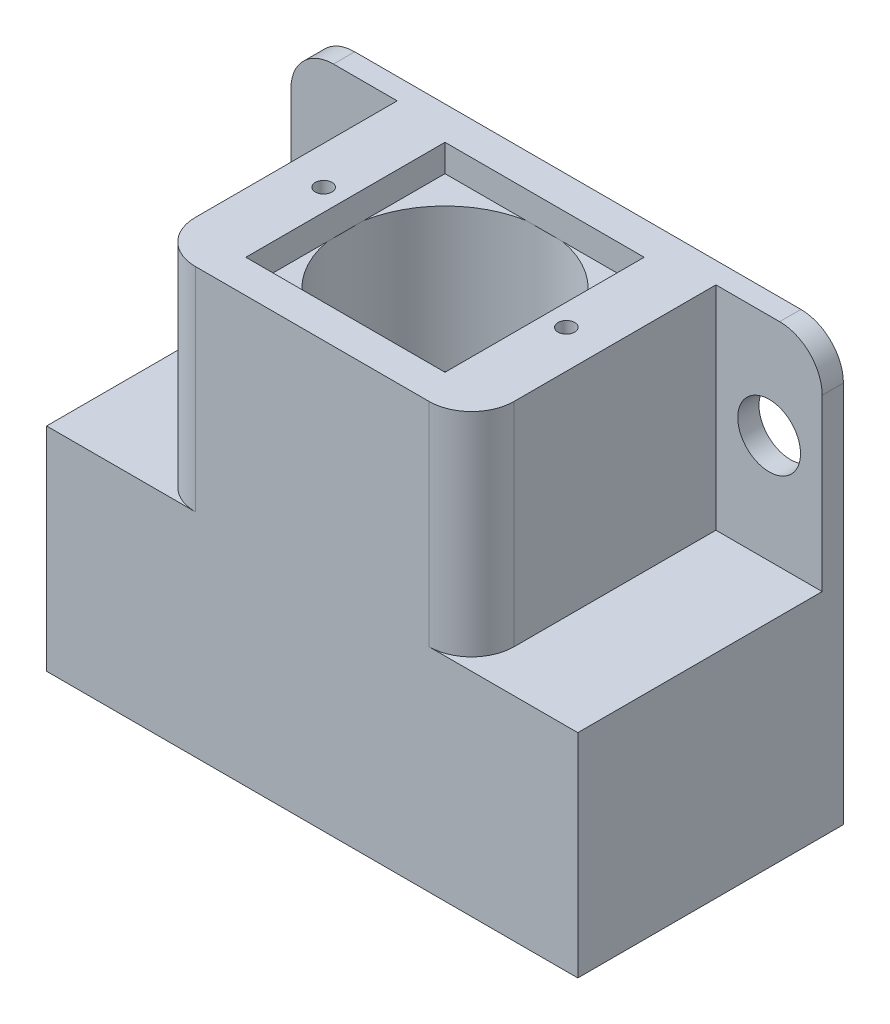
ISO-10303-21;
HEADER;
FILE_DESCRIPTION(('STEP AP214'),'2;1');
FILE_NAME('part.step','',(''),(''),'','','');
FILE_SCHEMA(('AUTOMOTIVE_DESIGN { 1 0 10303 214 1 1 1 1 }'));
ENDSEC;
DATA;
#1=APPLICATION_CONTEXT('core data for automotive mechanical design processes');
#2=APPLICATION_PROTOCOL_DEFINITION('international standard','automotive_design',2000,#1);
#3=PRODUCT_CONTEXT('',#1,'mechanical');
#4=PRODUCT('Part','Part','',(#3));
#5=PRODUCT_RELATED_PRODUCT_CATEGORY('part','',(#4));
#6=PRODUCT_DEFINITION_FORMATION('','',#4);
#7=PRODUCT_DEFINITION_CONTEXT('part definition',#1,'design');
#8=PRODUCT_DEFINITION('design','',#6,#7);
#9=PRODUCT_DEFINITION_SHAPE('','',#8);
#10=(LENGTH_UNIT() NAMED_UNIT(*) SI_UNIT(.MILLI.,.METRE.));
#11=(NAMED_UNIT(*) PLANE_ANGLE_UNIT() SI_UNIT($,.RADIAN.));
#12=(NAMED_UNIT(*) SI_UNIT($,.STERADIAN.) SOLID_ANGLE_UNIT());
#13=UNCERTAINTY_MEASURE_WITH_UNIT(LENGTH_MEASURE(1.E-05),#10,'distance_accuracy_value','');
#14=(GEOMETRIC_REPRESENTATION_CONTEXT(3) GLOBAL_UNCERTAINTY_ASSIGNED_CONTEXT((#13)) GLOBAL_UNIT_ASSIGNED_CONTEXT((#10,
#11,#12)) REPRESENTATION_CONTEXT('',''));
#15=CARTESIAN_POINT('',(0.,0.,0.));
#16=DIRECTION('',(0.,0.,1.));
#17=DIRECTION('',(1.,0.,0.));
#18=AXIS2_PLACEMENT_3D('',#15,#16,#17);
#19=CARTESIAN_POINT('',(0.,-3.25,0.));
#20=DIRECTION('',(0.,1.,0.));
#21=DIRECTION('',(0.,0.,1.));
#22=AXIS2_PLACEMENT_3D('',#19,#20,#21);
#23=PLANE('',#22);
#24=CARTESIAN_POINT('',(0.,-3.25,0.));
#25=DIRECTION('',(0.,1.,0.));
#26=DIRECTION('',(0.,0.,1.));
#27=AXIS2_PLACEMENT_3D('',#24,#25,#26);
#28=CIRCLE('',#27,12.108);
#29=CARTESIAN_POINT('',(2.20893493829518,-3.25,11.9048003107309));
#30=VERTEX_POINT('',#29);
#31=CARTESIAN_POINT('',(11.9048003107309,-3.25,2.20893493829519));
#32=VERTEX_POINT('',#31);
#33=EDGE_CURVE('E204',#30,#32,#28,.T.);
#34=ORIENTED_EDGE('',*,*,#33,.F.);
#35=DIRECTION('',(1.,0.,0.));
#36=VECTOR('',#35,1.);
#37=CARTESIAN_POINT('',(-11.9048003107309,-3.25,11.9048003107309));
#38=LINE('',#37,#36);
#39=CARTESIAN_POINT('',(11.9048003107309,-3.25,11.9048003107309));
#40=VERTEX_POINT('',#39);
#41=EDGE_CURVE('E197',#30,#40,#38,.T.);
#42=ORIENTED_EDGE('',*,*,#41,.T.);
#43=DIRECTION('',(0.,0.,-1.));
#44=VECTOR('',#43,1.);
#45=CARTESIAN_POINT('',(11.9048003107309,-3.25,11.9048003107309));
#46=LINE('',#45,#44);
#47=EDGE_CURVE('E215',#40,#32,#46,.T.);
#48=ORIENTED_EDGE('',*,*,#47,.T.);
#49=EDGE_LOOP('',(#34,#42,#48));
#50=FACE_BOUND('',#49,.T.);
#51=ADVANCED_FACE('F40',(#50),#23,.T.);
#52=CARTESIAN_POINT('',(11.9048003107309,-3.25,-2.20893493829518));
#53=VERTEX_POINT('',#52);
#54=CARTESIAN_POINT('',(2.20893493829518,-3.25,-11.9048003107309));
#55=VERTEX_POINT('',#54);
#56=EDGE_CURVE('E466',#53,#55,#28,.T.);
#57=ORIENTED_EDGE('',*,*,#56,.F.);
#58=CARTESIAN_POINT('',(11.9048003107309,-3.25,-11.9048003107309));
#59=VERTEX_POINT('',#58);
#60=EDGE_CURVE('E227',#53,#59,#46,.T.);
#61=ORIENTED_EDGE('',*,*,#60,.T.);
#62=DIRECTION('',(-1.,0.,0.));
#63=VECTOR('',#62,1.);
#64=CARTESIAN_POINT('',(11.9048003107309,-3.25,-11.9048003107309));
#65=LINE('',#64,#63);
#66=EDGE_CURVE('E238',#59,#55,#65,.T.);
#67=ORIENTED_EDGE('',*,*,#66,.T.);
#68=EDGE_LOOP('',(#57,#61,#67));
#69=FACE_BOUND('',#68,.T.);
#70=ADVANCED_FACE('F563',(#69),#23,.T.);
#71=CARTESIAN_POINT('',(-2.20893493829518,-3.25,-11.9048003107309));
#72=VERTEX_POINT('',#71);
#73=CARTESIAN_POINT('',(-11.9048003107309,-3.25,-2.20893493829518));
#74=VERTEX_POINT('',#73);
#75=EDGE_CURVE('E878',#72,#74,#28,.T.);
#76=ORIENTED_EDGE('',*,*,#75,.F.);
#77=CARTESIAN_POINT('',(-11.9048003107309,-3.25,-11.9048003107309));
#78=VERTEX_POINT('',#77);
#79=EDGE_CURVE('E236',#72,#78,#65,.T.);
#80=ORIENTED_EDGE('',*,*,#79,.T.);
#81=DIRECTION('',(0.,0.,1.));
#82=VECTOR('',#81,1.);
#83=CARTESIAN_POINT('',(-11.9048003107309,-3.25,-11.9048003107309));
#84=LINE('',#83,#82);
#85=EDGE_CURVE('E248',#78,#74,#84,.T.);
#86=ORIENTED_EDGE('',*,*,#85,.T.);
#87=EDGE_LOOP('',(#76,#80,#86));
#88=FACE_BOUND('',#87,.T.);
#89=ADVANCED_FACE('F569',(#88),#23,.T.);
#90=CARTESIAN_POINT('',(-31.75,-12.7,0.));
#91=DIRECTION('',(-1.,0.,0.));
#92=DIRECTION('',(0.,0.,1.));
#93=AXIS2_PLACEMENT_3D('',#90,#91,#92);
#94=PLANE('',#93);
#95=DIRECTION('',(0.,1.,0.));
#96=VECTOR('',#95,1.);
#97=CARTESIAN_POINT('',(-31.75,-25.4,-13.335));
#98=LINE('',#97,#96);
#99=CARTESIAN_POINT('',(-31.75,-25.4,-13.335));
#100=VERTEX_POINT('',#99);
#101=CARTESIAN_POINT('',(-31.75,-5.08,-13.335));
#102=VERTEX_POINT('',#101);
#103=EDGE_CURVE('E279',#100,#102,#98,.T.);
#104=ORIENTED_EDGE('',*,*,#103,.T.);
#105=DIRECTION('',(0.,0.,1.));
#106=VECTOR('',#105,1.);
#107=CARTESIAN_POINT('',(-31.75,-5.08,-15.875));
#108=LINE('',#107,#106);
#109=CARTESIAN_POINT('',(-31.75,-5.08,-15.875));
#110=VERTEX_POINT('',#109);
#111=EDGE_CURVE('E482',#102,#110,#108,.F.);
#112=ORIENTED_EDGE('',*,*,#111,.T.);
#113=DIRECTION('',(0.,1.,0.));
#114=VECTOR('',#113,1.);
#115=CARTESIAN_POINT('',(-31.75,-25.4,-15.875));
#116=LINE('',#115,#114);
#117=CARTESIAN_POINT('',(-31.75,-50.8,-15.875));
#118=VERTEX_POINT('',#117);
#119=EDGE_CURVE('E323',#118,#110,#116,.T.);
#120=ORIENTED_EDGE('',*,*,#119,.F.);
#121=DIRECTION('',(0.,0.,-1.));
#122=VECTOR('',#121,1.);
#123=CARTESIAN_POINT('',(-31.75,-50.8,15.875));
#124=LINE('',#123,#122);
#125=CARTESIAN_POINT('',(-31.75,-50.8,15.875));
#126=VERTEX_POINT('',#125);
#127=EDGE_CURVE('E312',#126,#118,#124,.T.);
#128=ORIENTED_EDGE('',*,*,#127,.F.);
#129=DIRECTION('',(0.,-1.,0.));
#130=VECTOR('',#129,1.);
#131=CARTESIAN_POINT('',(-31.75,-12.7,15.875));
#132=LINE('',#131,#130);
#133=CARTESIAN_POINT('',(-31.75,-25.4,15.875));
#134=VERTEX_POINT('',#133);
#135=EDGE_CURVE('E321',#134,#126,#132,.T.);
#136=ORIENTED_EDGE('',*,*,#135,.F.);
#137=DIRECTION('',(0.,0.,1.));
#138=VECTOR('',#137,1.);
#139=CARTESIAN_POINT('',(-31.75,-25.4,-13.335));
#140=LINE('',#139,#138);
#141=EDGE_CURVE('E263',#100,#134,#140,.T.);
#142=ORIENTED_EDGE('',*,*,#141,.F.);
#143=EDGE_LOOP('',(#104,#112,#120,#128,#136,#142));
#144=FACE_BOUND('',#143,.T.);
#145=ADVANCED_FACE('F525',(#144),#94,.T.);
#146=CARTESIAN_POINT('',(31.75,-12.7,0.));
#147=DIRECTION('',(1.,0.,0.));
#148=DIRECTION('',(0.,0.,-1.));
#149=AXIS2_PLACEMENT_3D('',#146,#147,#148);
#150=PLANE('',#149);
#151=DIRECTION('',(0.,1.,0.));
#152=VECTOR('',#151,1.);
#153=CARTESIAN_POINT('',(31.75,-25.4,-15.875));
#154=LINE('',#153,#152);
#155=CARTESIAN_POINT('',(31.75,-5.08,-15.875));
#156=VERTEX_POINT('',#155);
#157=CARTESIAN_POINT('',(31.75,-50.8,-15.875));
#158=VERTEX_POINT('',#157);
#159=EDGE_CURVE('E329',#156,#158,#154,.F.);
#160=ORIENTED_EDGE('',*,*,#159,.F.);
#161=DIRECTION('',(0.,0.,1.));
#162=VECTOR('',#161,1.);
#163=CARTESIAN_POINT('',(31.75,-5.08,-13.335));
#164=LINE('',#163,#162);
#165=CARTESIAN_POINT('',(31.75,-5.08,-13.335));
#166=VERTEX_POINT('',#165);
#167=EDGE_CURVE('E491',#156,#166,#164,.T.);
#168=ORIENTED_EDGE('',*,*,#167,.T.);
#169=DIRECTION('',(0.,1.,0.));
#170=VECTOR('',#169,1.);
#171=CARTESIAN_POINT('',(31.75,-25.4,-13.335));
#172=LINE('',#171,#170);
#173=CARTESIAN_POINT('',(31.75,-25.4,-13.335));
#174=VERTEX_POINT('',#173);
#175=EDGE_CURVE('E297',#174,#166,#172,.T.);
#176=ORIENTED_EDGE('',*,*,#175,.F.);
#177=DIRECTION('',(0.,0.,-1.));
#178=VECTOR('',#177,1.);
#179=CARTESIAN_POINT('',(31.75,-25.4,15.875));
#180=LINE('',#179,#178);
#181=CARTESIAN_POINT('',(31.75,-25.4,15.875));
#182=VERTEX_POINT('',#181);
#183=EDGE_CURVE('E287',#182,#174,#180,.T.);
#184=ORIENTED_EDGE('',*,*,#183,.F.);
#185=DIRECTION('',(0.,1.,0.));
#186=VECTOR('',#185,1.);
#187=CARTESIAN_POINT('',(31.75,-12.7,15.875));
#188=LINE('',#187,#186);
#189=CARTESIAN_POINT('',(31.75,-50.8,15.875));
#190=VERTEX_POINT('',#189);
#191=EDGE_CURVE('E318',#190,#182,#188,.T.);
#192=ORIENTED_EDGE('',*,*,#191,.F.);
#193=DIRECTION('',(0.,0.,1.));
#194=VECTOR('',#193,1.);
#195=CARTESIAN_POINT('',(31.75,-50.8,-15.875));
#196=LINE('',#195,#194);
#197=EDGE_CURVE('E304',#158,#190,#196,.T.);
#198=ORIENTED_EDGE('',*,*,#197,.F.);
#199=EDGE_LOOP('',(#160,#168,#176,#184,#192,#198));
#200=FACE_BOUND('',#199,.T.);
#201=ADVANCED_FACE('F535',(#200),#150,.T.);
#202=CARTESIAN_POINT('',(0.,-25.4,15.875));
#203=DIRECTION('',(0.,0.,-1.));
#204=DIRECTION('',(-1.,0.,0.));
#205=AXIS2_PLACEMENT_3D('',#202,#203,#204);
#206=PLANE('',#205);
#207=DIRECTION('',(1.,0.,0.));
#208=VECTOR('',#207,1.);
#209=CARTESIAN_POINT('',(19.05,-25.4,15.875));
#210=LINE('',#209,#208);
#211=CARTESIAN_POINT('',(13.97,-25.4,15.875));
#212=VERTEX_POINT('',#211);
#213=EDGE_CURVE('E285',#212,#182,#210,.T.);
#214=ORIENTED_EDGE('',*,*,#213,.F.);
#215=DIRECTION('',(0.,1.,0.));
#216=VECTOR('',#215,1.);
#217=CARTESIAN_POINT('',(13.97,-25.4,15.875));
#218=LINE('',#217,#216);
#219=CARTESIAN_POINT('',(13.97,0.,15.875));
#220=VERTEX_POINT('',#219);
#221=EDGE_CURVE('E465',#212,#220,#218,.T.);
#222=ORIENTED_EDGE('',*,*,#221,.T.);
#223=DIRECTION('',(1.,0.,0.));
#224=VECTOR('',#223,1.);
#225=CARTESIAN_POINT('',(0.,0.,15.875));
#226=LINE('',#225,#224);
#227=CARTESIAN_POINT('',(-13.97,0.,15.875));
#228=VERTEX_POINT('',#227);
#229=EDGE_CURVE('E324',#220,#228,#226,.F.);
#230=ORIENTED_EDGE('',*,*,#229,.T.);
#231=DIRECTION('',(0.,1.,0.));
#232=VECTOR('',#231,1.);
#233=CARTESIAN_POINT('',(-13.97,-25.4,15.875));
#234=LINE('',#233,#232);
#235=CARTESIAN_POINT('',(-13.97,-25.4,15.875));
#236=VERTEX_POINT('',#235);
#237=EDGE_CURVE('E461',#228,#236,#234,.F.);
#238=ORIENTED_EDGE('',*,*,#237,.T.);
#239=DIRECTION('',(1.,0.,0.));
#240=VECTOR('',#239,1.);
#241=CARTESIAN_POINT('',(-31.75,-25.4,15.875));
#242=LINE('',#241,#240);
#243=EDGE_CURVE('E265',#134,#236,#242,.T.);
#244=ORIENTED_EDGE('',*,*,#243,.F.);
#245=ORIENTED_EDGE('',*,*,#135,.T.);
#246=DIRECTION('',(-1.,0.,0.));
#247=VECTOR('',#246,1.);
#248=CARTESIAN_POINT('',(31.75,-50.8,15.875));
#249=LINE('',#248,#247);
#250=EDGE_CURVE('E309',#190,#126,#249,.T.);
#251=ORIENTED_EDGE('',*,*,#250,.F.);
#252=ORIENTED_EDGE('',*,*,#191,.T.);
#253=EDGE_LOOP('',(#214,#222,#230,#238,#244,#245,#251,#252));
#254=FACE_BOUND('',#253,.T.);
#255=ADVANCED_FACE('F505',(#254),#206,.F.);
#256=CARTESIAN_POINT('',(0.,-25.4,-15.875));
#257=DIRECTION('',(0.,0.,-1.));
#258=DIRECTION('',(-1.,0.,0.));
#259=AXIS2_PLACEMENT_3D('',#256,#257,#258);
#260=PLANE('',#259);
#261=CARTESIAN_POINT('',(-25.4129609454085,-12.4235546093226,-15.875));
#262=DIRECTION('',(0.,0.,-1.));
#263=DIRECTION('',(-1.,0.,0.));
#264=AXIS2_PLACEMENT_3D('',#261,#262,#263);
#265=CIRCLE('',#264,3.75399999999999);
#266=CARTESIAN_POINT('',(-29.1669609454085,-12.4235546093226,-15.875));
#267=VERTEX_POINT('',#266);
#268=EDGE_CURVE('E900',#267,#267,#265,.T.);
#269=ORIENTED_EDGE('',*,*,#268,.F.);
#270=EDGE_LOOP('',(#269));
#271=FACE_BOUND('',#270,.T.);
#272=CARTESIAN_POINT('',(25.4129609454085,-12.4235546093226,-15.875));
#273=DIRECTION('',(0.,0.,-1.));
#274=DIRECTION('',(-1.,0.,0.));
#275=AXIS2_PLACEMENT_3D('',#272,#273,#274);
#276=CIRCLE('',#275,3.75399999999999);
#277=CARTESIAN_POINT('',(21.6589609454085,-12.4235546093226,-15.875));
#278=VERTEX_POINT('',#277);
#279=EDGE_CURVE('E895',#278,#278,#276,.T.);
#280=ORIENTED_EDGE('',*,*,#279,.F.);
#281=EDGE_LOOP('',(#280));
#282=FACE_BOUND('',#281,.T.);
#283=ORIENTED_EDGE('',*,*,#119,.T.);
#284=CARTESIAN_POINT('',(-26.67,-5.08,-15.875));
#285=DIRECTION('',(0.,0.,-1.));
#286=DIRECTION('',(-1.,0.,0.));
#287=AXIS2_PLACEMENT_3D('',#284,#285,#286);
#288=CIRCLE('',#287,5.08);
#289=CARTESIAN_POINT('',(-26.67,0.,-15.875));
#290=VERTEX_POINT('',#289);
#291=EDGE_CURVE('E486',#110,#290,#288,.T.);
#292=ORIENTED_EDGE('',*,*,#291,.T.);
#293=DIRECTION('',(1.,0.,0.));
#294=VECTOR('',#293,1.);
#295=CARTESIAN_POINT('',(0.,0.,-15.875));
#296=LINE('',#295,#294);
#297=CARTESIAN_POINT('',(26.67,0.,-15.875));
#298=VERTEX_POINT('',#297);
#299=EDGE_CURVE('E328',#290,#298,#296,.T.);
#300=ORIENTED_EDGE('',*,*,#299,.T.);
#301=CARTESIAN_POINT('',(26.67,-5.08,-15.875));
#302=DIRECTION('',(0.,0.,-1.));
#303=DIRECTION('',(-1.,0.,0.));
#304=AXIS2_PLACEMENT_3D('',#301,#302,#303);
#305=CIRCLE('',#304,5.08);
#306=EDGE_CURVE('E484',#298,#156,#305,.T.);
#307=ORIENTED_EDGE('',*,*,#306,.T.);
#308=ORIENTED_EDGE('',*,*,#159,.T.);
#309=DIRECTION('',(1.,0.,0.));
#310=VECTOR('',#309,1.);
#311=CARTESIAN_POINT('',(-31.75,-50.8,-15.875));
#312=LINE('',#311,#310);
#313=EDGE_CURVE('E315',#118,#158,#312,.T.);
#314=ORIENTED_EDGE('',*,*,#313,.F.);
#315=EDGE_LOOP('',(#283,#292,#300,#307,#308,#314));
#316=FACE_BOUND('',#315,.T.);
#317=ADVANCED_FACE('F544',(#271,#282,#316),#260,.T.);
#318=CARTESIAN_POINT('',(0.,0.,0.));
#319=DIRECTION('',(0.,-1.,0.));
#320=DIRECTION('',(0.,0.,-1.));
#321=AXIS2_PLACEMENT_3D('',#318,#319,#320);
#322=PLANE('',#321);
#323=CARTESIAN_POINT('',(14.5034,0.,0.));
#324=DIRECTION('',(0.,1.,0.));
#325=DIRECTION('',(0.,0.,1.));
#326=AXIS2_PLACEMENT_3D('',#323,#324,#325);
#327=CIRCLE('',#326,0.999999999999989);
#328=CARTESIAN_POINT('',(14.5034,0.,0.999999999999989));
#329=VERTEX_POINT('',#328);
#330=EDGE_CURVE('E889',#329,#329,#327,.T.);
#331=ORIENTED_EDGE('',*,*,#330,.F.);
#332=EDGE_LOOP('',(#331));
#333=FACE_BOUND('',#332,.T.);
#334=CARTESIAN_POINT('',(-14.5034,0.,0.));
#335=DIRECTION('',(0.,1.,0.));
#336=DIRECTION('',(0.,0.,1.));
#337=AXIS2_PLACEMENT_3D('',#334,#335,#336);
#338=CIRCLE('',#337,0.999999999999989);
#339=CARTESIAN_POINT('',(-14.5034,0.,0.999999999999989));
#340=VERTEX_POINT('',#339);
#341=EDGE_CURVE('E883',#340,#340,#338,.T.);
#342=ORIENTED_EDGE('',*,*,#341,.F.);
#343=EDGE_LOOP('',(#342));
#344=FACE_BOUND('',#343,.T.);
#345=DIRECTION('',(0.,0.,-1.));
#346=VECTOR('',#345,1.);
#347=CARTESIAN_POINT('',(11.9048003107309,0.,11.9048003107309));
#348=LINE('',#347,#346);
#349=CARTESIAN_POINT('',(11.9048003107309,0.,11.9048003107309));
#350=VERTEX_POINT('',#349);
#351=CARTESIAN_POINT('',(11.9048003107309,0.,-11.9048003107309));
#352=VERTEX_POINT('',#351);
#353=EDGE_CURVE('E869',#350,#352,#348,.T.);
#354=ORIENTED_EDGE('',*,*,#353,.F.);
#355=DIRECTION('',(1.,0.,0.));
#356=VECTOR('',#355,1.);
#357=CARTESIAN_POINT('',(-11.9048003107309,0.,11.9048003107309));
#358=LINE('',#357,#356);
#359=CARTESIAN_POINT('',(-11.9048003107309,0.,11.9048003107309));
#360=VERTEX_POINT('',#359);
#361=EDGE_CURVE('E868',#360,#350,#358,.T.);
#362=ORIENTED_EDGE('',*,*,#361,.F.);
#363=DIRECTION('',(0.,0.,1.));
#364=VECTOR('',#363,1.);
#365=CARTESIAN_POINT('',(-11.9048003107309,0.,-11.9048003107309));
#366=LINE('',#365,#364);
#367=CARTESIAN_POINT('',(-11.9048003107309,0.,-11.9048003107309));
#368=VERTEX_POINT('',#367);
#369=EDGE_CURVE('E221',#368,#360,#366,.T.);
#370=ORIENTED_EDGE('',*,*,#369,.F.);
#371=DIRECTION('',(-1.,0.,0.));
#372=VECTOR('',#371,1.);
#373=CARTESIAN_POINT('',(11.9048003107309,0.,-11.9048003107309));
#374=LINE('',#373,#372);
#375=EDGE_CURVE('E223',#352,#368,#374,.T.);
#376=ORIENTED_EDGE('',*,*,#375,.F.);
#377=EDGE_LOOP('',(#354,#362,#370,#376));
#378=FACE_BOUND('',#377,.T.);
#379=ORIENTED_EDGE('',*,*,#229,.F.);
#380=CARTESIAN_POINT('',(13.97,0.,10.795));
#381=DIRECTION('',(0.,-1.,0.));
#382=DIRECTION('',(0.,0.,-1.));
#383=AXIS2_PLACEMENT_3D('',#380,#381,#382);
#384=CIRCLE('',#383,5.08);
#385=CARTESIAN_POINT('',(19.05,0.,10.795));
#386=VERTEX_POINT('',#385);
#387=EDGE_CURVE('E476',#220,#386,#384,.F.);
#388=ORIENTED_EDGE('',*,*,#387,.T.);
#389=DIRECTION('',(0.,0.,1.));
#390=VECTOR('',#389,1.);
#391=CARTESIAN_POINT('',(19.05,0.,-13.335));
#392=LINE('',#391,#390);
#393=CARTESIAN_POINT('',(19.05,0.,-13.335));
#394=VERTEX_POINT('',#393);
#395=EDGE_CURVE('E288',#394,#386,#392,.T.);
#396=ORIENTED_EDGE('',*,*,#395,.F.);
#397=DIRECTION('',(-1.,0.,0.));
#398=VECTOR('',#397,1.);
#399=CARTESIAN_POINT('',(31.75,0.,-13.335));
#400=LINE('',#399,#398);
#401=CARTESIAN_POINT('',(26.67,0.,-13.335));
#402=VERTEX_POINT('',#401);
#403=EDGE_CURVE('E282',#402,#394,#400,.T.);
#404=ORIENTED_EDGE('',*,*,#403,.F.);
#405=DIRECTION('',(0.,0.,1.));
#406=VECTOR('',#405,1.);
#407=CARTESIAN_POINT('',(26.67,0.,-15.875));
#408=LINE('',#407,#406);
#409=EDGE_CURVE('E469',#402,#298,#408,.F.);
#410=ORIENTED_EDGE('',*,*,#409,.T.);
#411=ORIENTED_EDGE('',*,*,#299,.F.);
#412=DIRECTION('',(0.,0.,1.));
#413=VECTOR('',#412,1.);
#414=CARTESIAN_POINT('',(-26.67,0.,-13.335));
#415=LINE('',#414,#413);
#416=CARTESIAN_POINT('',(-26.67,0.,-13.335));
#417=VERTEX_POINT('',#416);
#418=EDGE_CURVE('E473',#290,#417,#415,.T.);
#419=ORIENTED_EDGE('',*,*,#418,.T.);
#420=DIRECTION('',(-1.,0.,0.));
#421=VECTOR('',#420,1.);
#422=CARTESIAN_POINT('',(-19.05,0.,-13.335));
#423=LINE('',#422,#421);
#424=CARTESIAN_POINT('',(-19.05,0.,-13.335));
#425=VERTEX_POINT('',#424);
#426=EDGE_CURVE('E266',#425,#417,#423,.T.);
#427=ORIENTED_EDGE('',*,*,#426,.F.);
#428=DIRECTION('',(0.,0.,-1.));
#429=VECTOR('',#428,1.);
#430=CARTESIAN_POINT('',(-19.05,0.,15.875));
#431=LINE('',#430,#429);
#432=CARTESIAN_POINT('',(-19.05,0.,10.795));
#433=VERTEX_POINT('',#432);
#434=EDGE_CURVE('E274',#433,#425,#431,.T.);
#435=ORIENTED_EDGE('',*,*,#434,.F.);
#436=CARTESIAN_POINT('',(-13.97,0.,10.795));
#437=DIRECTION('',(0.,-1.,0.));
#438=DIRECTION('',(0.,0.,-1.));
#439=AXIS2_PLACEMENT_3D('',#436,#437,#438);
#440=CIRCLE('',#439,5.08);
#441=EDGE_CURVE('E471',#433,#228,#440,.F.);
#442=ORIENTED_EDGE('',*,*,#441,.T.);
#443=EDGE_LOOP('',(#379,#388,#396,#404,#410,#411,#419,#427,#435,#442));
#444=FACE_BOUND('',#443,.T.);
#445=ADVANCED_FACE('F508',(#333,#344,#378,#444),#322,.F.);
#446=CARTESIAN_POINT('',(0.,-50.8,0.));
#447=DIRECTION('',(0.,-1.,0.));
#448=DIRECTION('',(0.,0.,-1.));
#449=AXIS2_PLACEMENT_3D('',#446,#447,#448);
#450=PLANE('',#449);
#451=CARTESIAN_POINT('',(0.,-50.8,0.));
#452=DIRECTION('',(0.,1.,0.));
#453=DIRECTION('',(0.,0.,1.));
#454=AXIS2_PLACEMENT_3D('',#451,#452,#453);
#455=CIRCLE('',#454,12.108);
#456=CARTESIAN_POINT('',(0.,-50.8,12.108));
#457=VERTEX_POINT('',#456);
#458=EDGE_CURVE('E216',#457,#457,#455,.T.);
#459=ORIENTED_EDGE('',*,*,#458,.T.);
#460=EDGE_LOOP('',(#459));
#461=FACE_BOUND('',#460,.T.);
#462=ORIENTED_EDGE('',*,*,#197,.T.);
#463=ORIENTED_EDGE('',*,*,#250,.T.);
#464=ORIENTED_EDGE('',*,*,#127,.T.);
#465=ORIENTED_EDGE('',*,*,#313,.T.);
#466=EDGE_LOOP('',(#462,#463,#464,#465));
#467=FACE_BOUND('',#466,.T.);
#468=ADVANCED_FACE('F530',(#461,#467),#450,.T.);
#469=CARTESIAN_POINT('',(19.05,-25.4,-13.335));
#470=DIRECTION('',(-1.,0.,0.));
#471=DIRECTION('',(0.,0.,1.));
#472=AXIS2_PLACEMENT_3D('',#469,#470,#471);
#473=PLANE('',#472);
#474=ORIENTED_EDGE('',*,*,#395,.T.);
#475=DIRECTION('',(0.,1.,0.));
#476=VECTOR('',#475,1.);
#477=CARTESIAN_POINT('',(19.05,-25.4,10.795));
#478=LINE('',#477,#476);
#479=CARTESIAN_POINT('',(19.05,-25.4,10.795));
#480=VERTEX_POINT('',#479);
#481=EDGE_CURVE('E478',#386,#480,#478,.F.);
#482=ORIENTED_EDGE('',*,*,#481,.T.);
#483=DIRECTION('',(0.,0.,1.));
#484=VECTOR('',#483,1.);
#485=CARTESIAN_POINT('',(19.05,-25.4,-13.335));
#486=LINE('',#485,#484);
#487=CARTESIAN_POINT('',(19.05,-25.4,-13.335));
#488=VERTEX_POINT('',#487);
#489=EDGE_CURVE('E294',#488,#480,#486,.T.);
#490=ORIENTED_EDGE('',*,*,#489,.F.);
#491=DIRECTION('',(0.,1.,0.));
#492=VECTOR('',#491,1.);
#493=CARTESIAN_POINT('',(19.05,-25.4,-13.335));
#494=LINE('',#493,#492);
#495=EDGE_CURVE('E301',#488,#394,#494,.T.);
#496=ORIENTED_EDGE('',*,*,#495,.T.);
#497=EDGE_LOOP('',(#474,#482,#490,#496));
#498=FACE_BOUND('',#497,.T.);
#499=ADVANCED_FACE('F539',(#498),#473,.F.);
#500=CARTESIAN_POINT('',(31.75,-25.4,-13.335));
#501=DIRECTION('',(0.,0.,-1.));
#502=DIRECTION('',(-1.,0.,0.));
#503=AXIS2_PLACEMENT_3D('',#500,#501,#502);
#504=PLANE('',#503);
#505=CARTESIAN_POINT('',(25.4129609454085,-12.4235546093226,-13.335));
#506=DIRECTION('',(0.,0.,-1.));
#507=DIRECTION('',(-1.,0.,0.));
#508=AXIS2_PLACEMENT_3D('',#505,#506,#507);
#509=CIRCLE('',#508,3.75399999999998);
#510=CARTESIAN_POINT('',(21.6589609454085,-12.4235546093226,-13.335));
#511=VERTEX_POINT('',#510);
#512=EDGE_CURVE('E892',#511,#511,#509,.T.);
#513=ORIENTED_EDGE('',*,*,#512,.T.);
#514=EDGE_LOOP('',(#513));
#515=FACE_BOUND('',#514,.T.);
#516=ORIENTED_EDGE('',*,*,#175,.T.);
#517=CARTESIAN_POINT('',(26.67,-5.08,-13.335));
#518=DIRECTION('',(0.,0.,-1.));
#519=DIRECTION('',(-1.,0.,0.));
#520=AXIS2_PLACEMENT_3D('',#517,#518,#519);
#521=CIRCLE('',#520,5.08);
#522=EDGE_CURVE('E55',#166,#402,#521,.F.);
#523=ORIENTED_EDGE('',*,*,#522,.T.);
#524=ORIENTED_EDGE('',*,*,#403,.T.);
#525=ORIENTED_EDGE('',*,*,#495,.F.);
#526=DIRECTION('',(-1.,0.,0.));
#527=VECTOR('',#526,1.);
#528=CARTESIAN_POINT('',(31.75,-25.4,-13.335));
#529=LINE('',#528,#527);
#530=EDGE_CURVE('E291',#174,#488,#529,.T.);
#531=ORIENTED_EDGE('',*,*,#530,.F.);
#532=EDGE_LOOP('',(#516,#523,#524,#525,#531));
#533=FACE_BOUND('',#532,.T.);
#534=ADVANCED_FACE('F558',(#515,#533),#504,.F.);
#535=CARTESIAN_POINT('',(0.,-25.4,0.));
#536=DIRECTION('',(0.,1.,0.));
#537=DIRECTION('',(0.,0.,1.));
#538=AXIS2_PLACEMENT_3D('',#535,#536,#537);
#539=PLANE('',#538);
#540=ORIENTED_EDGE('',*,*,#213,.T.);
#541=ORIENTED_EDGE('',*,*,#183,.T.);
#542=ORIENTED_EDGE('',*,*,#530,.T.);
#543=ORIENTED_EDGE('',*,*,#489,.T.);
#544=CARTESIAN_POINT('',(13.97,-25.4,10.795));
#545=DIRECTION('',(0.,1.,0.));
#546=DIRECTION('',(0.,0.,1.));
#547=AXIS2_PLACEMENT_3D('',#544,#545,#546);
#548=CIRCLE('',#547,5.08);
#549=EDGE_CURVE('E48',#480,#212,#548,.F.);
#550=ORIENTED_EDGE('',*,*,#549,.T.);
#551=EDGE_LOOP('',(#540,#541,#542,#543,#550));
#552=FACE_BOUND('',#551,.T.);
#553=ADVANCED_FACE('F497',(#552),#539,.T.);
#554=CARTESIAN_POINT('',(-19.05,-25.4,-13.335));
#555=DIRECTION('',(0.,0.,-1.));
#556=DIRECTION('',(-1.,0.,0.));
#557=AXIS2_PLACEMENT_3D('',#554,#555,#556);
#558=PLANE('',#557);
#559=CARTESIAN_POINT('',(-25.4129609454085,-12.4235546093226,-13.335));
#560=DIRECTION('',(0.,0.,-1.));
#561=DIRECTION('',(-1.,0.,0.));
#562=AXIS2_PLACEMENT_3D('',#559,#560,#561);
#563=CIRCLE('',#562,3.75399999999998);
#564=CARTESIAN_POINT('',(-29.1669609454085,-12.4235546093226,-13.335));
#565=VERTEX_POINT('',#564);
#566=EDGE_CURVE('E898',#565,#565,#563,.T.);
#567=ORIENTED_EDGE('',*,*,#566,.T.);
#568=EDGE_LOOP('',(#567));
#569=FACE_BOUND('',#568,.T.);
#570=ORIENTED_EDGE('',*,*,#426,.T.);
#571=CARTESIAN_POINT('',(-26.67,-5.08,-13.335));
#572=DIRECTION('',(0.,0.,-1.));
#573=DIRECTION('',(-1.,0.,0.));
#574=AXIS2_PLACEMENT_3D('',#571,#572,#573);
#575=CIRCLE('',#574,5.08);
#576=EDGE_CURVE('E480',#417,#102,#575,.F.);
#577=ORIENTED_EDGE('',*,*,#576,.T.);
#578=ORIENTED_EDGE('',*,*,#103,.F.);
#579=DIRECTION('',(-1.,0.,0.));
#580=VECTOR('',#579,1.);
#581=CARTESIAN_POINT('',(-19.05,-25.4,-13.335));
#582=LINE('',#581,#580);
#583=CARTESIAN_POINT('',(-19.05,-25.4,-13.335));
#584=VERTEX_POINT('',#583);
#585=EDGE_CURVE('E270',#584,#100,#582,.T.);
#586=ORIENTED_EDGE('',*,*,#585,.F.);
#587=DIRECTION('',(0.,1.,0.));
#588=VECTOR('',#587,1.);
#589=CARTESIAN_POINT('',(-19.05,-25.4,-13.335));
#590=LINE('',#589,#588);
#591=EDGE_CURVE('E273',#584,#425,#590,.T.);
#592=ORIENTED_EDGE('',*,*,#591,.T.);
#593=EDGE_LOOP('',(#570,#577,#578,#586,#592));
#594=FACE_BOUND('',#593,.T.);
#595=ADVANCED_FACE('F549',(#569,#594),#558,.F.);
#596=CARTESIAN_POINT('',(-19.05,-25.4,15.875));
#597=DIRECTION('',(1.,0.,0.));
#598=DIRECTION('',(0.,0.,-1.));
#599=AXIS2_PLACEMENT_3D('',#596,#597,#598);
#600=PLANE('',#599);
#601=DIRECTION('',(0.,0.,-1.));
#602=VECTOR('',#601,1.);
#603=CARTESIAN_POINT('',(-19.05,-25.4,15.875));
#604=LINE('',#603,#602);
#605=CARTESIAN_POINT('',(-19.05,-25.4,10.795));
#606=VERTEX_POINT('',#605);
#607=EDGE_CURVE('E268',#606,#584,#604,.T.);
#608=ORIENTED_EDGE('',*,*,#607,.F.);
#609=DIRECTION('',(0.,1.,0.));
#610=VECTOR('',#609,1.);
#611=CARTESIAN_POINT('',(-19.05,-25.4,10.795));
#612=LINE('',#611,#610);
#613=EDGE_CURVE('E488',#606,#433,#612,.T.);
#614=ORIENTED_EDGE('',*,*,#613,.T.);
#615=ORIENTED_EDGE('',*,*,#434,.T.);
#616=ORIENTED_EDGE('',*,*,#591,.F.);
#617=EDGE_LOOP('',(#608,#614,#615,#616));
#618=FACE_BOUND('',#617,.T.);
#619=ADVANCED_FACE('F516',(#618),#600,.F.);
#620=CARTESIAN_POINT('',(0.,-25.4,0.));
#621=DIRECTION('',(0.,1.,0.));
#622=DIRECTION('',(0.,0.,1.));
#623=AXIS2_PLACEMENT_3D('',#620,#621,#622);
#624=PLANE('',#623);
#625=ORIENTED_EDGE('',*,*,#141,.T.);
#626=ORIENTED_EDGE('',*,*,#243,.T.);
#627=CARTESIAN_POINT('',(-13.97,-25.4,10.795));
#628=DIRECTION('',(0.,1.,0.));
#629=DIRECTION('',(0.,0.,1.));
#630=AXIS2_PLACEMENT_3D('',#627,#628,#629);
#631=CIRCLE('',#630,5.08);
#632=EDGE_CURVE('E12',#236,#606,#631,.F.);
#633=ORIENTED_EDGE('',*,*,#632,.T.);
#634=ORIENTED_EDGE('',*,*,#607,.T.);
#635=ORIENTED_EDGE('',*,*,#585,.T.);
#636=EDGE_LOOP('',(#625,#626,#633,#634,#635));
#637=FACE_BOUND('',#636,.T.);
#638=ADVANCED_FACE('F519',(#637),#624,.T.);
#639=CARTESIAN_POINT('',(-11.9048003107309,-3.25,11.9048003107309));
#640=DIRECTION('',(0.,0.,1.));
#641=DIRECTION('',(1.,0.,0.));
#642=AXIS2_PLACEMENT_3D('',#639,#640,#641);
#643=PLANE('',#642);
#644=ORIENTED_EDGE('',*,*,#361,.T.);
#645=DIRECTION('',(0.,1.,0.));
#646=VECTOR('',#645,1.);
#647=CARTESIAN_POINT('',(11.9048003107309,-3.25,11.9048003107309));
#648=LINE('',#647,#646);
#649=EDGE_CURVE('E220',#40,#350,#648,.T.);
#650=ORIENTED_EDGE('',*,*,#649,.F.);
#651=ORIENTED_EDGE('',*,*,#41,.F.);
#652=CARTESIAN_POINT('',(-2.20893493829518,-3.25,11.9048003107309));
#653=VERTEX_POINT('',#652);
#654=EDGE_CURVE('E187',#653,#30,#38,.T.);
#655=ORIENTED_EDGE('',*,*,#654,.F.);
#656=CARTESIAN_POINT('',(-11.9048003107309,-3.25,11.9048003107309));
#657=VERTEX_POINT('',#656);
#658=EDGE_CURVE('E196',#657,#653,#38,.T.);
#659=ORIENTED_EDGE('',*,*,#658,.F.);
#660=DIRECTION('',(0.,1.,0.));
#661=VECTOR('',#660,1.);
#662=CARTESIAN_POINT('',(-11.9048003107309,-3.25,11.9048003107309));
#663=LINE('',#662,#661);
#664=EDGE_CURVE('E276',#657,#360,#663,.T.);
#665=ORIENTED_EDGE('',*,*,#664,.T.);
#666=EDGE_LOOP('',(#644,#650,#651,#655,#659,#665));
#667=FACE_BOUND('',#666,.T.);
#668=ADVANCED_FACE('F218',(#667),#643,.F.);
#669=CARTESIAN_POINT('',(-11.9048003107309,-3.25,-11.9048003107309));
#670=DIRECTION('',(-1.,0.,0.));
#671=DIRECTION('',(0.,0.,1.));
#672=AXIS2_PLACEMENT_3D('',#669,#670,#671);
#673=PLANE('',#672);
#674=ORIENTED_EDGE('',*,*,#369,.T.);
#675=ORIENTED_EDGE('',*,*,#664,.F.);
#676=CARTESIAN_POINT('',(-11.9048003107309,-3.25,2.20893493829519));
#677=VERTEX_POINT('',#676);
#678=EDGE_CURVE('E245',#677,#657,#84,.T.);
#679=ORIENTED_EDGE('',*,*,#678,.F.);
#680=EDGE_CURVE('E247',#74,#677,#84,.T.);
#681=ORIENTED_EDGE('',*,*,#680,.F.);
#682=ORIENTED_EDGE('',*,*,#85,.F.);
#683=DIRECTION('',(0.,1.,0.));
#684=VECTOR('',#683,1.);
#685=CARTESIAN_POINT('',(-11.9048003107309,-3.25,-11.9048003107309));
#686=LINE('',#685,#684);
#687=EDGE_CURVE('E259',#78,#368,#686,.T.);
#688=ORIENTED_EDGE('',*,*,#687,.T.);
#689=EDGE_LOOP('',(#674,#675,#679,#681,#682,#688));
#690=FACE_BOUND('',#689,.T.);
#691=ADVANCED_FACE('F827',(#690),#673,.F.);
#692=CARTESIAN_POINT('',(11.9048003107309,-3.25,-11.9048003107309));
#693=DIRECTION('',(0.,0.,-1.));
#694=DIRECTION('',(-1.,0.,0.));
#695=AXIS2_PLACEMENT_3D('',#692,#693,#694);
#696=PLANE('',#695);
#697=ORIENTED_EDGE('',*,*,#375,.T.);
#698=ORIENTED_EDGE('',*,*,#687,.F.);
#699=ORIENTED_EDGE('',*,*,#79,.F.);
#700=EDGE_CURVE('E237',#55,#72,#65,.T.);
#701=ORIENTED_EDGE('',*,*,#700,.F.);
#702=ORIENTED_EDGE('',*,*,#66,.F.);
#703=DIRECTION('',(0.,1.,0.));
#704=VECTOR('',#703,1.);
#705=CARTESIAN_POINT('',(11.9048003107309,-3.25,-11.9048003107309));
#706=LINE('',#705,#704);
#707=EDGE_CURVE('E254',#59,#352,#706,.T.);
#708=ORIENTED_EDGE('',*,*,#707,.T.);
#709=EDGE_LOOP('',(#697,#698,#699,#701,#702,#708));
#710=FACE_BOUND('',#709,.T.);
#711=ADVANCED_FACE('F580',(#710),#696,.F.);
#712=CARTESIAN_POINT('',(11.9048003107309,-3.25,11.9048003107309));
#713=DIRECTION('',(1.,0.,0.));
#714=DIRECTION('',(0.,0.,-1.));
#715=AXIS2_PLACEMENT_3D('',#712,#713,#714);
#716=PLANE('',#715);
#717=ORIENTED_EDGE('',*,*,#353,.T.);
#718=ORIENTED_EDGE('',*,*,#707,.F.);
#719=ORIENTED_EDGE('',*,*,#60,.F.);
#720=EDGE_CURVE('E229',#32,#53,#46,.T.);
#721=ORIENTED_EDGE('',*,*,#720,.F.);
#722=ORIENTED_EDGE('',*,*,#47,.F.);
#723=ORIENTED_EDGE('',*,*,#649,.T.);
#724=EDGE_LOOP('',(#717,#718,#719,#721,#722,#723));
#725=FACE_BOUND('',#724,.T.);
#726=ADVANCED_FACE('F573',(#725),#716,.F.);
#727=EDGE_CURVE('E207',#677,#653,#28,.T.);
#728=ORIENTED_EDGE('',*,*,#727,.F.);
#729=ORIENTED_EDGE('',*,*,#678,.T.);
#730=ORIENTED_EDGE('',*,*,#658,.T.);
#731=EDGE_LOOP('',(#728,#729,#730));
#732=FACE_BOUND('',#731,.T.);
#733=ADVANCED_FACE('F565',(#732),#23,.T.);
#734=CARTESIAN_POINT('',(12.108,-3.25,0.));
#735=DIRECTION('',(0.,1.,0.));
#736=DIRECTION('',(0.,0.,1.));
#737=AXIS2_PLACEMENT_3D('',#734,#735,#736);
#738=PLANE('',#737);
#739=ORIENTED_EDGE('',*,*,#654,.T.);
#740=EDGE_CURVE('E190',#653,#30,#28,.T.);
#741=ORIENTED_EDGE('',*,*,#740,.F.);
#742=EDGE_LOOP('',(#739,#741));
#743=FACE_BOUND('',#742,.T.);
#744=ADVANCED_FACE('F189',(#743),#738,.F.);
#745=ORIENTED_EDGE('',*,*,#720,.T.);
#746=EDGE_CURVE('E217',#32,#53,#28,.T.);
#747=ORIENTED_EDGE('',*,*,#746,.F.);
#748=EDGE_LOOP('',(#745,#747));
#749=FACE_BOUND('',#748,.T.);
#750=ADVANCED_FACE('F578',(#749),#738,.F.);
#751=ORIENTED_EDGE('',*,*,#700,.T.);
#752=EDGE_CURVE('E877',#55,#72,#28,.T.);
#753=ORIENTED_EDGE('',*,*,#752,.F.);
#754=EDGE_LOOP('',(#751,#753));
#755=FACE_BOUND('',#754,.T.);
#756=ADVANCED_FACE('F784',(#755),#738,.F.);
#757=ORIENTED_EDGE('',*,*,#680,.T.);
#758=EDGE_CURVE('E208',#74,#677,#28,.T.);
#759=ORIENTED_EDGE('',*,*,#758,.F.);
#760=EDGE_LOOP('',(#757,#759));
#761=FACE_BOUND('',#760,.T.);
#762=ADVANCED_FACE('F579',(#761),#738,.F.);
#763=CARTESIAN_POINT('',(0.,-3.25,0.));
#764=DIRECTION('',(0.,1.,0.));
#765=DIRECTION('',(0.,0.,1.));
#766=AXIS2_PLACEMENT_3D('',#763,#764,#765);
#767=CYLINDRICAL_SURFACE('',#766,12.108);
#768=ORIENTED_EDGE('',*,*,#458,.F.);
#769=EDGE_LOOP('',(#768));
#770=FACE_BOUND('',#769,.T.);
#771=ORIENTED_EDGE('',*,*,#33,.T.);
#772=ORIENTED_EDGE('',*,*,#746,.T.);
#773=ORIENTED_EDGE('',*,*,#56,.T.);
#774=ORIENTED_EDGE('',*,*,#752,.T.);
#775=ORIENTED_EDGE('',*,*,#75,.T.);
#776=ORIENTED_EDGE('',*,*,#758,.T.);
#777=ORIENTED_EDGE('',*,*,#727,.T.);
#778=ORIENTED_EDGE('',*,*,#740,.T.);
#779=EDGE_LOOP('',(#771,#772,#773,#774,#775,#776,#777,#778));
#780=FACE_BOUND('',#779,.T.);
#781=ADVANCED_FACE('F202',(#770,#780),#767,.F.);
#782=CARTESIAN_POINT('',(-14.5034,-2.54,0.));
#783=DIRECTION('',(0.,-1.,0.));
#784=DIRECTION('',(0.,0.,-1.));
#785=AXIS2_PLACEMENT_3D('',#782,#783,#784);
#786=PLANE('',#785);
#787=CARTESIAN_POINT('',(-14.5034,-2.54,0.));
#788=DIRECTION('',(0.,1.,0.));
#789=DIRECTION('',(0.,0.,1.));
#790=AXIS2_PLACEMENT_3D('',#787,#788,#789);
#791=CIRCLE('',#790,0.999999999999987);
#792=CARTESIAN_POINT('',(-14.5034,-2.54,0.999999999999987));
#793=VERTEX_POINT('',#792);
#794=EDGE_CURVE('E209',#793,#793,#791,.T.);
#795=ORIENTED_EDGE('',*,*,#794,.T.);
#796=EDGE_LOOP('',(#795));
#797=FACE_BOUND('',#796,.T.);
#798=ADVANCED_FACE('F756',(#797),#786,.F.);
#799=CARTESIAN_POINT('',(-14.5034,0.,0.));
#800=DIRECTION('',(0.,1.,0.));
#801=DIRECTION('',(0.,0.,1.));
#802=AXIS2_PLACEMENT_3D('',#799,#800,#801);
#803=CYLINDRICAL_SURFACE('',#802,0.999999999999988);
#804=ORIENTED_EDGE('',*,*,#794,.F.);
#805=EDGE_LOOP('',(#804));
#806=FACE_BOUND('',#805,.T.);
#807=ORIENTED_EDGE('',*,*,#341,.T.);
#808=EDGE_LOOP('',(#807));
#809=FACE_BOUND('',#808,.T.);
#810=ADVANCED_FACE('F746',(#806,#809),#803,.F.);
#811=CARTESIAN_POINT('',(14.5034,-2.54,0.));
#812=DIRECTION('',(0.,-1.,0.));
#813=DIRECTION('',(0.,0.,-1.));
#814=AXIS2_PLACEMENT_3D('',#811,#812,#813);
#815=PLANE('',#814);
#816=CARTESIAN_POINT('',(14.5034,-2.54,0.));
#817=DIRECTION('',(0.,1.,0.));
#818=DIRECTION('',(0.,0.,1.));
#819=AXIS2_PLACEMENT_3D('',#816,#817,#818);
#820=CIRCLE('',#819,0.999999999999987);
#821=CARTESIAN_POINT('',(14.5034,-2.54,0.999999999999987));
#822=VERTEX_POINT('',#821);
#823=EDGE_CURVE('E886',#822,#822,#820,.T.);
#824=ORIENTED_EDGE('',*,*,#823,.T.);
#825=EDGE_LOOP('',(#824));
#826=FACE_BOUND('',#825,.T.);
#827=ADVANCED_FACE('F736',(#826),#815,.F.);
#828=CARTESIAN_POINT('',(14.5034,0.,0.));
#829=DIRECTION('',(0.,1.,0.));
#830=DIRECTION('',(0.,0.,1.));
#831=AXIS2_PLACEMENT_3D('',#828,#829,#830);
#832=CYLINDRICAL_SURFACE('',#831,0.999999999999988);
#833=ORIENTED_EDGE('',*,*,#823,.F.);
#834=EDGE_LOOP('',(#833));
#835=FACE_BOUND('',#834,.T.);
#836=ORIENTED_EDGE('',*,*,#330,.T.);
#837=EDGE_LOOP('',(#836));
#838=FACE_BOUND('',#837,.T.);
#839=ADVANCED_FACE('F726',(#835,#838),#832,.F.);
#840=CARTESIAN_POINT('',(25.4129609454085,-12.4235546093226,-15.875));
#841=DIRECTION('',(0.,0.,-1.));
#842=DIRECTION('',(-1.,0.,0.));
#843=AXIS2_PLACEMENT_3D('',#840,#841,#842);
#844=CYLINDRICAL_SURFACE('',#843,3.75399999999998);
#845=ORIENTED_EDGE('',*,*,#279,.T.);
#846=EDGE_LOOP('',(#845));
#847=FACE_BOUND('',#846,.T.);
#848=ORIENTED_EDGE('',*,*,#512,.F.);
#849=EDGE_LOOP('',(#848));
#850=FACE_BOUND('',#849,.T.);
#851=ADVANCED_FACE('F716',(#847,#850),#844,.F.);
#852=CARTESIAN_POINT('',(-25.4129609454085,-12.4235546093226,-15.875));
#853=DIRECTION('',(0.,0.,-1.));
#854=DIRECTION('',(-1.,0.,0.));
#855=AXIS2_PLACEMENT_3D('',#852,#853,#854);
#856=CYLINDRICAL_SURFACE('',#855,3.75399999999998);
#857=ORIENTED_EDGE('',*,*,#268,.T.);
#858=EDGE_LOOP('',(#857));
#859=FACE_BOUND('',#858,.T.);
#860=ORIENTED_EDGE('',*,*,#566,.F.);
#861=EDGE_LOOP('',(#860));
#862=FACE_BOUND('',#861,.T.);
#863=ADVANCED_FACE('F608',(#859,#862),#856,.F.);
#864=CARTESIAN_POINT('',(13.97,-25.4,10.795));
#865=DIRECTION('',(0.,1.,0.));
#866=DIRECTION('',(0.,0.,1.));
#867=AXIS2_PLACEMENT_3D('',#864,#865,#866);
#868=CYLINDRICAL_SURFACE('',#867,5.08);
#869=ORIENTED_EDGE('',*,*,#549,.F.);
#870=ORIENTED_EDGE('',*,*,#481,.F.);
#871=ORIENTED_EDGE('',*,*,#387,.F.);
#872=ORIENTED_EDGE('',*,*,#221,.F.);
#873=EDGE_LOOP('',(#869,#870,#871,#872));
#874=FACE_BOUND('',#873,.T.);
#875=ADVANCED_FACE('F502',(#874),#868,.T.);
#876=CARTESIAN_POINT('',(-26.67,-5.08,0.));
#877=DIRECTION('',(0.,0.,-1.));
#878=DIRECTION('',(-1.,0.,0.));
#879=AXIS2_PLACEMENT_3D('',#876,#877,#878);
#880=CYLINDRICAL_SURFACE('',#879,5.08);
#881=ORIENTED_EDGE('',*,*,#291,.F.);
#882=ORIENTED_EDGE('',*,*,#111,.F.);
#883=ORIENTED_EDGE('',*,*,#576,.F.);
#884=ORIENTED_EDGE('',*,*,#418,.F.);
#885=EDGE_LOOP('',(#881,#882,#883,#884));
#886=FACE_BOUND('',#885,.T.);
#887=ADVANCED_FACE('F548',(#886),#880,.T.);
#888=CARTESIAN_POINT('',(-13.97,-25.4,10.795));
#889=DIRECTION('',(0.,1.,0.));
#890=DIRECTION('',(0.,0.,1.));
#891=AXIS2_PLACEMENT_3D('',#888,#889,#890);
#892=CYLINDRICAL_SURFACE('',#891,5.08);
#893=ORIENTED_EDGE('',*,*,#632,.F.);
#894=ORIENTED_EDGE('',*,*,#237,.F.);
#895=ORIENTED_EDGE('',*,*,#441,.F.);
#896=ORIENTED_EDGE('',*,*,#613,.F.);
#897=EDGE_LOOP('',(#893,#894,#895,#896));
#898=FACE_BOUND('',#897,.T.);
#899=ADVANCED_FACE('F514',(#898),#892,.T.);
#900=CARTESIAN_POINT('',(26.67,-5.08,0.));
#901=DIRECTION('',(0.,0.,-1.));
#902=DIRECTION('',(-1.,0.,0.));
#903=AXIS2_PLACEMENT_3D('',#900,#901,#902);
#904=CYLINDRICAL_SURFACE('',#903,5.08);
#905=ORIENTED_EDGE('',*,*,#306,.F.);
#906=ORIENTED_EDGE('',*,*,#409,.F.);
#907=ORIENTED_EDGE('',*,*,#522,.F.);
#908=ORIENTED_EDGE('',*,*,#167,.F.);
#909=EDGE_LOOP('',(#905,#906,#907,#908));
#910=FACE_BOUND('',#909,.T.);
#911=ADVANCED_FACE('F42',(#910),#904,.T.);
#912=CLOSED_SHELL('',(#51,#70,#89,#145,#201,#255,#317,#445,#468,#499,#534,#553,#595,#619,#638,
#668,#691,#711,#726,#733,#744,#750,#756,#762,#781,#798,#810,#827,#839,#851,#863,#875,#887,#899,#911));
#913=MANIFOLD_SOLID_BREP('B2',#912);
#914=ADVANCED_BREP_SHAPE_REPRESENTATION('',(#18,#913),#14);
#915=SHAPE_DEFINITION_REPRESENTATION(#9,#914);
ENDSEC;
END-ISO-10303-21;
